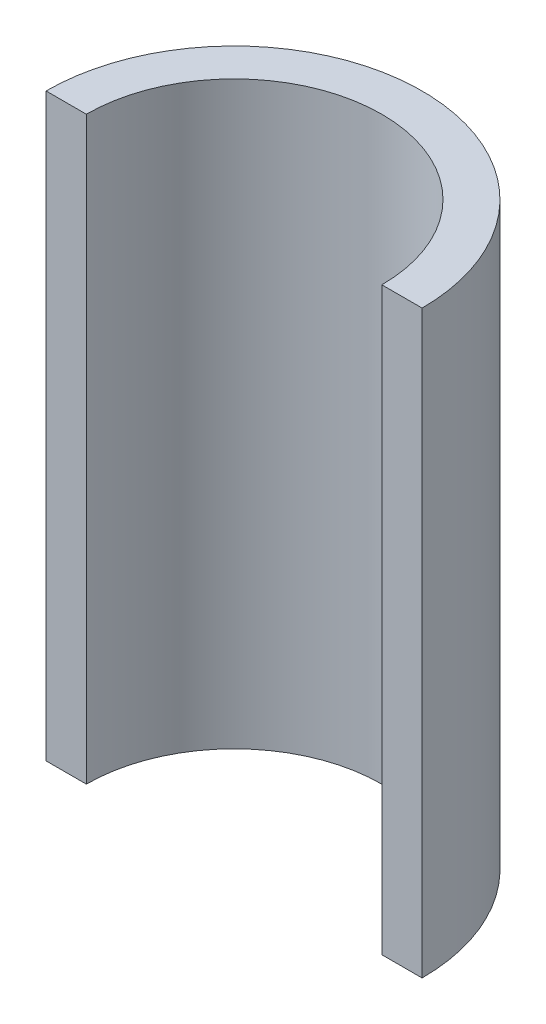
ISO-10303-21;
HEADER;
FILE_DESCRIPTION(('STEP AP214'),'2;1');
FILE_NAME('part.step','',(''),(''),'','','');
FILE_SCHEMA(('AUTOMOTIVE_DESIGN { 1 0 10303 214 1 1 1 1 }'));
ENDSEC;
DATA;
#1=APPLICATION_CONTEXT('core data for automotive mechanical design processes');
#2=APPLICATION_PROTOCOL_DEFINITION('international standard','automotive_design',2000,#1);
#3=PRODUCT_CONTEXT('',#1,'mechanical');
#4=PRODUCT('Part','Part','',(#3));
#5=PRODUCT_RELATED_PRODUCT_CATEGORY('part','',(#4));
#6=PRODUCT_DEFINITION_FORMATION('','',#4);
#7=PRODUCT_DEFINITION_CONTEXT('part definition',#1,'design');
#8=PRODUCT_DEFINITION('design','',#6,#7);
#9=PRODUCT_DEFINITION_SHAPE('','',#8);
#10=(LENGTH_UNIT() NAMED_UNIT(*) SI_UNIT(.MILLI.,.METRE.));
#11=(NAMED_UNIT(*) PLANE_ANGLE_UNIT() SI_UNIT($,.RADIAN.));
#12=(NAMED_UNIT(*) SI_UNIT($,.STERADIAN.) SOLID_ANGLE_UNIT());
#13=UNCERTAINTY_MEASURE_WITH_UNIT(LENGTH_MEASURE(1.E-05),#10,'distance_accuracy_value','');
#14=(GEOMETRIC_REPRESENTATION_CONTEXT(3) GLOBAL_UNCERTAINTY_ASSIGNED_CONTEXT((#13)) GLOBAL_UNIT_ASSIGNED_CONTEXT((#10,
#11,#12)) REPRESENTATION_CONTEXT('',''));
#15=CARTESIAN_POINT('',(0.,0.,0.));
#16=DIRECTION('',(0.,0.,1.));
#17=DIRECTION('',(1.,0.,0.));
#18=AXIS2_PLACEMENT_3D('',#15,#16,#17);
#19=CARTESIAN_POINT('',(0.,34.56,0.));
#20=DIRECTION('',(0.,-1.,0.));
#21=DIRECTION('',(0.,0.,-1.));
#22=AXIS2_PLACEMENT_3D('',#19,#20,#21);
#23=CYLINDRICAL_SURFACE('',#22,17.6);
#24=CARTESIAN_POINT('',(0.,-34.56,0.));
#25=DIRECTION('',(0.,-1.,0.));
#26=DIRECTION('',(0.,0.,1.));
#27=AXIS2_PLACEMENT_3D('',#24,#25,#26);
#28=CIRCLE('',#27,17.6);
#29=CARTESIAN_POINT('',(-17.6,-34.56,0.));
#30=VERTEX_POINT('',#29);
#31=CARTESIAN_POINT('',(17.6,-34.56,0.));
#32=VERTEX_POINT('',#31);
#33=EDGE_CURVE('E96',#30,#32,#28,.T.);
#34=ORIENTED_EDGE('',*,*,#33,.T.);
#35=DIRECTION('',(0.,-1.,0.));
#36=VECTOR('',#35,1.);
#37=CARTESIAN_POINT('',(17.6,34.56,0.));
#38=LINE('',#37,#36);
#39=CARTESIAN_POINT('',(17.6,34.56,0.));
#40=VERTEX_POINT('',#39);
#41=EDGE_CURVE('E11',#40,#32,#38,.T.);
#42=ORIENTED_EDGE('',*,*,#41,.F.);
#43=CARTESIAN_POINT('',(0.,34.56,0.));
#44=DIRECTION('',(0.,-1.,0.));
#45=DIRECTION('',(0.,0.,1.));
#46=AXIS2_PLACEMENT_3D('',#43,#44,#45);
#47=CIRCLE('',#46,17.6);
#48=CARTESIAN_POINT('',(-17.6,34.56,0.));
#49=VERTEX_POINT('',#48);
#50=EDGE_CURVE('E84',#49,#40,#47,.T.);
#51=ORIENTED_EDGE('',*,*,#50,.F.);
#52=DIRECTION('',(0.,-1.,0.));
#53=VECTOR('',#52,1.);
#54=CARTESIAN_POINT('',(-17.6,34.56,0.));
#55=LINE('',#54,#53);
#56=EDGE_CURVE('E92',#49,#30,#55,.T.);
#57=ORIENTED_EDGE('',*,*,#56,.T.);
#58=EDGE_LOOP('',(#34,#42,#51,#57));
#59=FACE_BOUND('',#58,.T.);
#60=ADVANCED_FACE('F33',(#59),#23,.F.);
#61=CARTESIAN_POINT('',(17.6,34.56,0.));
#62=DIRECTION('',(0.,0.,-1.));
#63=DIRECTION('',(-1.,0.,0.));
#64=AXIS2_PLACEMENT_3D('',#61,#62,#63);
#65=PLANE('',#64);
#66=DIRECTION('',(1.,0.,0.));
#67=VECTOR('',#66,1.);
#68=CARTESIAN_POINT('',(17.6,-34.56,0.));
#69=LINE('',#68,#67);
#70=CARTESIAN_POINT('',(22.4,-34.56,0.));
#71=VERTEX_POINT('',#70);
#72=EDGE_CURVE('E88',#32,#71,#69,.T.);
#73=ORIENTED_EDGE('',*,*,#72,.T.);
#74=DIRECTION('',(0.,-1.,0.));
#75=VECTOR('',#74,1.);
#76=CARTESIAN_POINT('',(22.4,34.56,0.));
#77=LINE('',#76,#75);
#78=CARTESIAN_POINT('',(22.4,34.56,0.));
#79=VERTEX_POINT('',#78);
#80=EDGE_CURVE('E41',#79,#71,#77,.T.);
#81=ORIENTED_EDGE('',*,*,#80,.F.);
#82=DIRECTION('',(1.,0.,0.));
#83=VECTOR('',#82,1.);
#84=CARTESIAN_POINT('',(17.6,34.56,0.));
#85=LINE('',#84,#83);
#86=EDGE_CURVE('E79',#40,#79,#85,.T.);
#87=ORIENTED_EDGE('',*,*,#86,.F.);
#88=ORIENTED_EDGE('',*,*,#41,.T.);
#89=EDGE_LOOP('',(#73,#81,#87,#88));
#90=FACE_BOUND('',#89,.T.);
#91=ADVANCED_FACE('F87',(#90),#65,.F.);
#92=CARTESIAN_POINT('',(0.,34.56,0.));
#93=DIRECTION('',(0.,-1.,0.));
#94=DIRECTION('',(0.,0.,-1.));
#95=AXIS2_PLACEMENT_3D('',#92,#93,#94);
#96=CYLINDRICAL_SURFACE('',#95,22.4);
#97=CARTESIAN_POINT('',(0.,-34.56,0.));
#98=DIRECTION('',(0.,1.,0.));
#99=DIRECTION('',(0.,0.,1.));
#100=AXIS2_PLACEMENT_3D('',#97,#98,#99);
#101=CIRCLE('',#100,22.4);
#102=CARTESIAN_POINT('',(-22.4,-34.56,0.));
#103=VERTEX_POINT('',#102);
#104=EDGE_CURVE('E66',#71,#103,#101,.T.);
#105=ORIENTED_EDGE('',*,*,#104,.T.);
#106=DIRECTION('',(0.,-1.,0.));
#107=VECTOR('',#106,1.);
#108=CARTESIAN_POINT('',(-22.4,34.56,0.));
#109=LINE('',#108,#107);
#110=CARTESIAN_POINT('',(-22.4,34.56,0.));
#111=VERTEX_POINT('',#110);
#112=EDGE_CURVE('E89',#111,#103,#109,.T.);
#113=ORIENTED_EDGE('',*,*,#112,.F.);
#114=CARTESIAN_POINT('',(0.,34.56,0.));
#115=DIRECTION('',(0.,1.,0.));
#116=DIRECTION('',(0.,0.,1.));
#117=AXIS2_PLACEMENT_3D('',#114,#115,#116);
#118=CIRCLE('',#117,22.4);
#119=EDGE_CURVE('E82',#79,#111,#118,.T.);
#120=ORIENTED_EDGE('',*,*,#119,.F.);
#121=ORIENTED_EDGE('',*,*,#80,.T.);
#122=EDGE_LOOP('',(#105,#113,#120,#121));
#123=FACE_BOUND('',#122,.T.);
#124=ADVANCED_FACE('F90',(#123),#96,.T.);
#125=CARTESIAN_POINT('',(-17.6,34.56,0.));
#126=DIRECTION('',(0.,0.,-1.));
#127=DIRECTION('',(-1.,0.,0.));
#128=AXIS2_PLACEMENT_3D('',#125,#126,#127);
#129=PLANE('',#128);
#130=DIRECTION('',(1.,0.,0.));
#131=VECTOR('',#130,1.);
#132=CARTESIAN_POINT('',(-17.6,-34.56,0.));
#133=LINE('',#132,#131);
#134=EDGE_CURVE('E72',#103,#30,#133,.T.);
#135=ORIENTED_EDGE('',*,*,#134,.T.);
#136=ORIENTED_EDGE('',*,*,#56,.F.);
#137=DIRECTION('',(1.,0.,0.));
#138=VECTOR('',#137,1.);
#139=CARTESIAN_POINT('',(-17.6,34.56,0.));
#140=LINE('',#139,#138);
#141=EDGE_CURVE('E49',#111,#49,#140,.T.);
#142=ORIENTED_EDGE('',*,*,#141,.F.);
#143=ORIENTED_EDGE('',*,*,#112,.T.);
#144=EDGE_LOOP('',(#135,#136,#142,#143));
#145=FACE_BOUND('',#144,.T.);
#146=ADVANCED_FACE('F103',(#145),#129,.F.);
#147=CARTESIAN_POINT('',(0.,34.56,0.));
#148=DIRECTION('',(0.,1.,0.));
#149=DIRECTION('',(0.,0.,1.));
#150=AXIS2_PLACEMENT_3D('',#147,#148,#149);
#151=PLANE('',#150);
#152=ORIENTED_EDGE('',*,*,#50,.T.);
#153=ORIENTED_EDGE('',*,*,#86,.T.);
#154=ORIENTED_EDGE('',*,*,#119,.T.);
#155=ORIENTED_EDGE('',*,*,#141,.T.);
#156=EDGE_LOOP('',(#152,#153,#154,#155));
#157=FACE_BOUND('',#156,.T.);
#158=ADVANCED_FACE('F80',(#157),#151,.T.);
#159=CARTESIAN_POINT('',(0.,-34.56,0.));
#160=DIRECTION('',(0.,1.,0.));
#161=DIRECTION('',(0.,0.,1.));
#162=AXIS2_PLACEMENT_3D('',#159,#160,#161);
#163=PLANE('',#162);
#164=ORIENTED_EDGE('',*,*,#33,.F.);
#165=ORIENTED_EDGE('',*,*,#134,.F.);
#166=ORIENTED_EDGE('',*,*,#104,.F.);
#167=ORIENTED_EDGE('',*,*,#72,.F.);
#168=EDGE_LOOP('',(#164,#165,#166,#167));
#169=FACE_BOUND('',#168,.T.);
#170=ADVANCED_FACE('F106',(#169),#163,.F.);
#171=CLOSED_SHELL('',(#60,#91,#124,#146,#158,#170));
#172=MANIFOLD_SOLID_BREP('B2',#171);
#173=ADVANCED_BREP_SHAPE_REPRESENTATION('',(#18,#172),#14);
#174=SHAPE_DEFINITION_REPRESENTATION(#9,#173);
ENDSEC;
END-ISO-10303-21;
